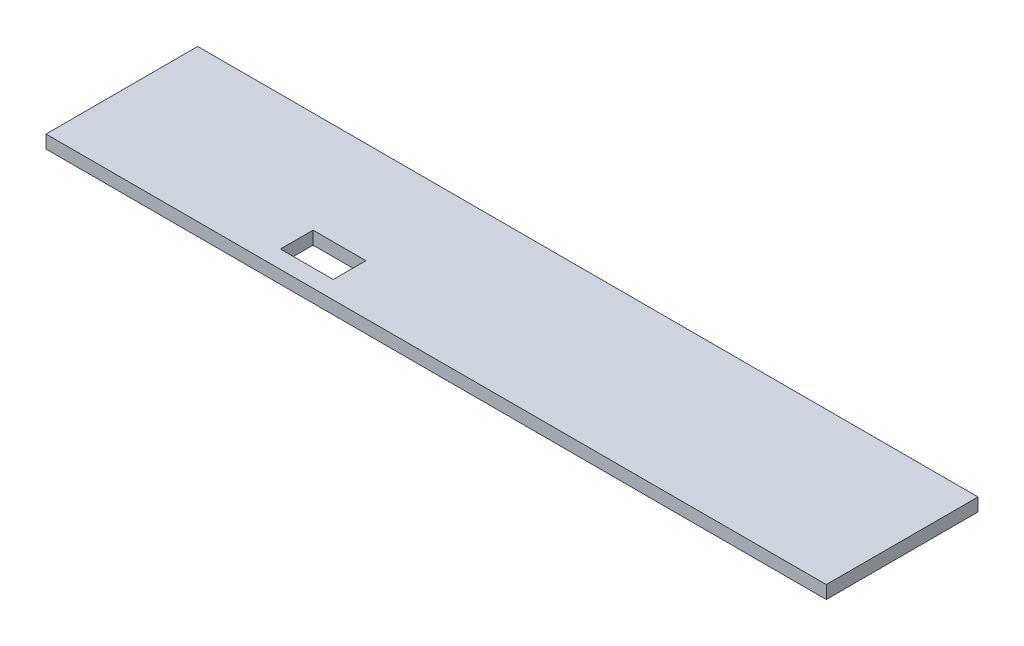
ISO-10303-21;
HEADER;
FILE_DESCRIPTION(('STEP AP214'),'2;1');
FILE_NAME('part.step','',(''),(''),'','','');
FILE_SCHEMA(('AUTOMOTIVE_DESIGN { 1 0 10303 214 1 1 1 1 }'));
ENDSEC;
DATA;
#1=APPLICATION_CONTEXT('core data for automotive mechanical design processes');
#2=APPLICATION_PROTOCOL_DEFINITION('international standard','automotive_design',2000,#1);
#3=PRODUCT_CONTEXT('',#1,'mechanical');
#4=PRODUCT('Part','Part','',(#3));
#5=PRODUCT_RELATED_PRODUCT_CATEGORY('part','',(#4));
#6=PRODUCT_DEFINITION_FORMATION('','',#4);
#7=PRODUCT_DEFINITION_CONTEXT('part definition',#1,'design');
#8=PRODUCT_DEFINITION('design','',#6,#7);
#9=PRODUCT_DEFINITION_SHAPE('','',#8);
#10=(LENGTH_UNIT() NAMED_UNIT(*) SI_UNIT(.MILLI.,.METRE.));
#11=(NAMED_UNIT(*) PLANE_ANGLE_UNIT() SI_UNIT($,.RADIAN.));
#12=(NAMED_UNIT(*) SI_UNIT($,.STERADIAN.) SOLID_ANGLE_UNIT());
#13=UNCERTAINTY_MEASURE_WITH_UNIT(LENGTH_MEASURE(1.E-05),#10,'distance_accuracy_value','');
#14=(GEOMETRIC_REPRESENTATION_CONTEXT(3) GLOBAL_UNCERTAINTY_ASSIGNED_CONTEXT((#13)) GLOBAL_UNIT_ASSIGNED_CONTEXT((#10,
#11,#12)) REPRESENTATION_CONTEXT('',''));
#15=CARTESIAN_POINT('',(0.,0.,0.));
#16=DIRECTION('',(0.,0.,1.));
#17=DIRECTION('',(1.,0.,0.));
#18=AXIS2_PLACEMENT_3D('',#15,#16,#17);
#19=CARTESIAN_POINT('',(-104.686936777344,3.,-23.6057346795657));
#20=DIRECTION('',(1.,0.,0.));
#21=DIRECTION('',(0.,0.,-1.));
#22=AXIS2_PLACEMENT_3D('',#19,#20,#21);
#23=PLANE('',#22);
#24=DIRECTION('',(0.,0.,1.));
#25=VECTOR('',#24,1.);
#26=CARTESIAN_POINT('',(-104.686936777344,0.,-23.6057346795657));
#27=LINE('',#26,#25);
#28=CARTESIAN_POINT('',(-104.686936777344,0.,-58.6057346795657));
#29=VERTEX_POINT('',#28);
#30=CARTESIAN_POINT('',(-104.686936777344,0.,-23.6057346795657));
#31=VERTEX_POINT('',#30);
#32=EDGE_CURVE('E130',#29,#31,#27,.T.);
#33=ORIENTED_EDGE('',*,*,#32,.T.);
#34=DIRECTION('',(0.,-1.,0.));
#35=VECTOR('',#34,1.);
#36=CARTESIAN_POINT('',(-104.686936777344,3.,-23.6057346795657));
#37=LINE('',#36,#35);
#38=CARTESIAN_POINT('',(-104.686936777344,3.,-23.6057346795657));
#39=VERTEX_POINT('',#38);
#40=EDGE_CURVE('E11',#39,#31,#37,.T.);
#41=ORIENTED_EDGE('',*,*,#40,.F.);
#42=DIRECTION('',(0.,0.,1.));
#43=VECTOR('',#42,1.);
#44=CARTESIAN_POINT('',(-104.686936777344,3.,-23.6057346795657));
#45=LINE('',#44,#43);
#46=CARTESIAN_POINT('',(-104.686936777344,3.,-58.6057346795657));
#47=VERTEX_POINT('',#46);
#48=EDGE_CURVE('E134',#47,#39,#45,.T.);
#49=ORIENTED_EDGE('',*,*,#48,.F.);
#50=DIRECTION('',(0.,-1.,0.));
#51=VECTOR('',#50,1.);
#52=CARTESIAN_POINT('',(-104.686936777344,3.,-58.6057346795657));
#53=LINE('',#52,#51);
#54=EDGE_CURVE('E144',#47,#29,#53,.T.);
#55=ORIENTED_EDGE('',*,*,#54,.T.);
#56=EDGE_LOOP('',(#33,#41,#49,#55));
#57=FACE_BOUND('',#56,.T.);
#58=ADVANCED_FACE('F33',(#57),#23,.F.);
#59=CARTESIAN_POINT('',(-104.686936777344,3.,-23.6057346795657));
#60=DIRECTION('',(0.,0.,-1.));
#61=DIRECTION('',(-1.,0.,0.));
#62=AXIS2_PLACEMENT_3D('',#59,#60,#61);
#63=PLANE('',#62);
#64=DIRECTION('',(1.,0.,0.));
#65=VECTOR('',#64,1.);
#66=CARTESIAN_POINT('',(-104.686936777344,0.,-23.6057346795657));
#67=LINE('',#66,#65);
#68=CARTESIAN_POINT('',(75.3130632226565,0.,-23.6057346795657));
#69=VERTEX_POINT('',#68);
#70=EDGE_CURVE('E147',#31,#69,#67,.T.);
#71=ORIENTED_EDGE('',*,*,#70,.T.);
#72=DIRECTION('',(0.,-1.,0.));
#73=VECTOR('',#72,1.);
#74=CARTESIAN_POINT('',(75.3130632226565,3.,-23.6057346795657));
#75=LINE('',#74,#73);
#76=CARTESIAN_POINT('',(75.3130632226565,3.,-23.6057346795657));
#77=VERTEX_POINT('',#76);
#78=EDGE_CURVE('E40',#77,#69,#75,.T.);
#79=ORIENTED_EDGE('',*,*,#78,.F.);
#80=DIRECTION('',(1.,0.,0.));
#81=VECTOR('',#80,1.);
#82=CARTESIAN_POINT('',(-104.686936777344,3.,-23.6057346795657));
#83=LINE('',#82,#81);
#84=EDGE_CURVE('E137',#39,#77,#83,.T.);
#85=ORIENTED_EDGE('',*,*,#84,.F.);
#86=ORIENTED_EDGE('',*,*,#40,.T.);
#87=EDGE_LOOP('',(#71,#79,#85,#86));
#88=FACE_BOUND('',#87,.T.);
#89=ADVANCED_FACE('F175',(#88),#63,.F.);
#90=CARTESIAN_POINT('',(75.3130632226565,3.,-23.6057346795657));
#91=DIRECTION('',(-1.,0.,0.));
#92=DIRECTION('',(0.,0.,1.));
#93=AXIS2_PLACEMENT_3D('',#90,#91,#92);
#94=PLANE('',#93);
#95=DIRECTION('',(0.,0.,-1.));
#96=VECTOR('',#95,1.);
#97=CARTESIAN_POINT('',(75.3130632226565,0.,-23.6057346795657));
#98=LINE('',#97,#96);
#99=CARTESIAN_POINT('',(75.3130632226565,0.,-58.6057346795657));
#100=VERTEX_POINT('',#99);
#101=EDGE_CURVE('E149',#69,#100,#98,.T.);
#102=ORIENTED_EDGE('',*,*,#101,.T.);
#103=DIRECTION('',(0.,-1.,0.));
#104=VECTOR('',#103,1.);
#105=CARTESIAN_POINT('',(75.3130632226565,3.,-58.6057346795657));
#106=LINE('',#105,#104);
#107=CARTESIAN_POINT('',(75.3130632226565,3.,-58.6057346795657));
#108=VERTEX_POINT('',#107);
#109=EDGE_CURVE('E154',#108,#100,#106,.T.);
#110=ORIENTED_EDGE('',*,*,#109,.F.);
#111=DIRECTION('',(0.,0.,-1.));
#112=VECTOR('',#111,1.);
#113=CARTESIAN_POINT('',(75.3130632226565,3.,-23.6057346795657));
#114=LINE('',#113,#112);
#115=EDGE_CURVE('E140',#77,#108,#114,.T.);
#116=ORIENTED_EDGE('',*,*,#115,.F.);
#117=ORIENTED_EDGE('',*,*,#78,.T.);
#118=EDGE_LOOP('',(#102,#110,#116,#117));
#119=FACE_BOUND('',#118,.T.);
#120=ADVANCED_FACE('F161',(#119),#94,.F.);
#121=CARTESIAN_POINT('',(-104.686936777344,3.,-58.6057346795657));
#122=DIRECTION('',(0.,0.,1.));
#123=DIRECTION('',(1.,0.,0.));
#124=AXIS2_PLACEMENT_3D('',#121,#122,#123);
#125=PLANE('',#124);
#126=DIRECTION('',(-1.,0.,0.));
#127=VECTOR('',#126,1.);
#128=CARTESIAN_POINT('',(-104.686936777344,0.,-58.6057346795657));
#129=LINE('',#128,#127);
#130=EDGE_CURVE('E138',#100,#29,#129,.T.);
#131=ORIENTED_EDGE('',*,*,#130,.T.);
#132=ORIENTED_EDGE('',*,*,#54,.F.);
#133=DIRECTION('',(-1.,0.,0.));
#134=VECTOR('',#133,1.);
#135=CARTESIAN_POINT('',(-104.686936777344,3.,-58.6057346795657));
#136=LINE('',#135,#134);
#137=EDGE_CURVE('E142',#108,#47,#136,.T.);
#138=ORIENTED_EDGE('',*,*,#137,.F.);
#139=ORIENTED_EDGE('',*,*,#109,.T.);
#140=EDGE_LOOP('',(#131,#132,#138,#139));
#141=FACE_BOUND('',#140,.T.);
#142=ADVANCED_FACE('F168',(#141),#125,.F.);
#143=CARTESIAN_POINT('',(0.,3.,0.));
#144=DIRECTION('',(0.,-1.,0.));
#145=DIRECTION('',(0.,0.,-1.));
#146=AXIS2_PLACEMENT_3D('',#143,#144,#145);
#147=PLANE('',#146);
#148=DIRECTION('',(1.,0.,0.));
#149=VECTOR('',#148,1.);
#150=CARTESIAN_POINT('',(-54.6869367773435,3.,-27.6757346795657));
#151=LINE('',#150,#149);
#152=CARTESIAN_POINT('',(-54.6869367773435,3.,-27.6757346795657));
#153=VERTEX_POINT('',#152);
#154=CARTESIAN_POINT('',(-42.4869367773435,3.,-27.6757346795657));
#155=VERTEX_POINT('',#154);
#156=EDGE_CURVE('E124',#153,#155,#151,.T.);
#157=ORIENTED_EDGE('',*,*,#156,.F.);
#158=DIRECTION('',(0.,0.,1.));
#159=VECTOR('',#158,1.);
#160=CARTESIAN_POINT('',(-54.6869367773435,3.,-35.2057346795657));
#161=LINE('',#160,#159);
#162=CARTESIAN_POINT('',(-54.6869367773435,3.,-35.2057346795657));
#163=VERTEX_POINT('',#162);
#164=EDGE_CURVE('E47',#163,#153,#161,.T.);
#165=ORIENTED_EDGE('',*,*,#164,.F.);
#166=DIRECTION('',(-1.,0.,0.));
#167=VECTOR('',#166,1.);
#168=CARTESIAN_POINT('',(-54.6869367773435,3.,-35.2057346795657));
#169=LINE('',#168,#167);
#170=CARTESIAN_POINT('',(-42.4869367773435,3.,-35.2057346795657));
#171=VERTEX_POINT('',#170);
#172=EDGE_CURVE('E115',#171,#163,#169,.T.);
#173=ORIENTED_EDGE('',*,*,#172,.F.);
#174=DIRECTION('',(0.,0.,-1.));
#175=VECTOR('',#174,1.);
#176=CARTESIAN_POINT('',(-42.4869367773435,3.,-35.2057346795657));
#177=LINE('',#176,#175);
#178=EDGE_CURVE('E118',#155,#171,#177,.T.);
#179=ORIENTED_EDGE('',*,*,#178,.F.);
#180=EDGE_LOOP('',(#157,#165,#173,#179));
#181=FACE_BOUND('',#180,.T.);
#182=ORIENTED_EDGE('',*,*,#48,.T.);
#183=ORIENTED_EDGE('',*,*,#84,.T.);
#184=ORIENTED_EDGE('',*,*,#115,.T.);
#185=ORIENTED_EDGE('',*,*,#137,.T.);
#186=EDGE_LOOP('',(#182,#183,#184,#185));
#187=FACE_BOUND('',#186,.T.);
#188=ADVANCED_FACE('F174',(#181,#187),#147,.F.);
#189=CARTESIAN_POINT('',(0.,0.,0.));
#190=DIRECTION('',(0.,-1.,0.));
#191=DIRECTION('',(0.,0.,-1.));
#192=AXIS2_PLACEMENT_3D('',#189,#190,#191);
#193=PLANE('',#192);
#194=DIRECTION('',(0.,0.,1.));
#195=VECTOR('',#194,1.);
#196=CARTESIAN_POINT('',(-54.6869367773435,0.,-35.2057346795657));
#197=LINE('',#196,#195);
#198=CARTESIAN_POINT('',(-54.6869367773435,0.,-35.2057346795657));
#199=VERTEX_POINT('',#198);
#200=CARTESIAN_POINT('',(-54.6869367773435,0.,-27.6757346795657));
#201=VERTEX_POINT('',#200);
#202=EDGE_CURVE('E99',#199,#201,#197,.T.);
#203=ORIENTED_EDGE('',*,*,#202,.T.);
#204=DIRECTION('',(1.,0.,0.));
#205=VECTOR('',#204,1.);
#206=CARTESIAN_POINT('',(-54.6869367773435,0.,-27.6757346795657));
#207=LINE('',#206,#205);
#208=CARTESIAN_POINT('',(-42.4869367773435,0.,-27.6757346795657));
#209=VERTEX_POINT('',#208);
#210=EDGE_CURVE('E108',#201,#209,#207,.T.);
#211=ORIENTED_EDGE('',*,*,#210,.T.);
#212=DIRECTION('',(0.,0.,-1.));
#213=VECTOR('',#212,1.);
#214=CARTESIAN_POINT('',(-42.4869367773435,0.,-35.2057346795657));
#215=LINE('',#214,#213);
#216=CARTESIAN_POINT('',(-42.4869367773435,0.,-35.2057346795657));
#217=VERTEX_POINT('',#216);
#218=EDGE_CURVE('E55',#209,#217,#215,.T.);
#219=ORIENTED_EDGE('',*,*,#218,.T.);
#220=DIRECTION('',(-1.,0.,0.));
#221=VECTOR('',#220,1.);
#222=CARTESIAN_POINT('',(-54.6869367773435,0.,-35.2057346795657));
#223=LINE('',#222,#221);
#224=EDGE_CURVE('E105',#217,#199,#223,.T.);
#225=ORIENTED_EDGE('',*,*,#224,.T.);
#226=EDGE_LOOP('',(#203,#211,#219,#225));
#227=FACE_BOUND('',#226,.T.);
#228=ORIENTED_EDGE('',*,*,#32,.F.);
#229=ORIENTED_EDGE('',*,*,#130,.F.);
#230=ORIENTED_EDGE('',*,*,#101,.F.);
#231=ORIENTED_EDGE('',*,*,#70,.F.);
#232=EDGE_LOOP('',(#228,#229,#230,#231));
#233=FACE_BOUND('',#232,.T.);
#234=ADVANCED_FACE('F112',(#227,#233),#193,.T.);
#235=CARTESIAN_POINT('',(-54.6869367773435,0.,-35.2057346795657));
#236=DIRECTION('',(-1.,0.,0.));
#237=DIRECTION('',(0.,0.,1.));
#238=AXIS2_PLACEMENT_3D('',#235,#236,#237);
#239=PLANE('',#238);
#240=ORIENTED_EDGE('',*,*,#164,.T.);
#241=DIRECTION('',(0.,1.,0.));
#242=VECTOR('',#241,1.);
#243=CARTESIAN_POINT('',(-54.6869367773435,0.,-27.6757346795657));
#244=LINE('',#243,#242);
#245=EDGE_CURVE('E95',#201,#153,#244,.T.);
#246=ORIENTED_EDGE('',*,*,#245,.F.);
#247=ORIENTED_EDGE('',*,*,#202,.F.);
#248=DIRECTION('',(0.,1.,0.));
#249=VECTOR('',#248,1.);
#250=CARTESIAN_POINT('',(-54.6869367773435,0.,-35.2057346795657));
#251=LINE('',#250,#249);
#252=EDGE_CURVE('E128',#199,#163,#251,.T.);
#253=ORIENTED_EDGE('',*,*,#252,.T.);
#254=EDGE_LOOP('',(#240,#246,#247,#253));
#255=FACE_BOUND('',#254,.T.);
#256=ADVANCED_FACE('F97',(#255),#239,.F.);
#257=CARTESIAN_POINT('',(-54.6869367773435,0.,-35.2057346795657));
#258=DIRECTION('',(0.,0.,-1.));
#259=DIRECTION('',(-1.,0.,0.));
#260=AXIS2_PLACEMENT_3D('',#257,#258,#259);
#261=PLANE('',#260);
#262=ORIENTED_EDGE('',*,*,#172,.T.);
#263=ORIENTED_EDGE('',*,*,#252,.F.);
#264=ORIENTED_EDGE('',*,*,#224,.F.);
#265=DIRECTION('',(0.,1.,0.));
#266=VECTOR('',#265,1.);
#267=CARTESIAN_POINT('',(-42.4869367773435,0.,-35.2057346795657));
#268=LINE('',#267,#266);
#269=EDGE_CURVE('E131',#217,#171,#268,.T.);
#270=ORIENTED_EDGE('',*,*,#269,.T.);
#271=EDGE_LOOP('',(#262,#263,#264,#270));
#272=FACE_BOUND('',#271,.T.);
#273=ADVANCED_FACE('F192',(#272),#261,.F.);
#274=CARTESIAN_POINT('',(-42.4869367773435,0.,-35.2057346795657));
#275=DIRECTION('',(1.,0.,0.));
#276=DIRECTION('',(0.,0.,-1.));
#277=AXIS2_PLACEMENT_3D('',#274,#275,#276);
#278=PLANE('',#277);
#279=ORIENTED_EDGE('',*,*,#178,.T.);
#280=ORIENTED_EDGE('',*,*,#269,.F.);
#281=ORIENTED_EDGE('',*,*,#218,.F.);
#282=DIRECTION('',(0.,1.,0.));
#283=VECTOR('',#282,1.);
#284=CARTESIAN_POINT('',(-42.4869367773435,0.,-27.6757346795657));
#285=LINE('',#284,#283);
#286=EDGE_CURVE('E104',#209,#155,#285,.T.);
#287=ORIENTED_EDGE('',*,*,#286,.T.);
#288=EDGE_LOOP('',(#279,#280,#281,#287));
#289=FACE_BOUND('',#288,.T.);
#290=ADVANCED_FACE('F195',(#289),#278,.F.);
#291=CARTESIAN_POINT('',(-54.6869367773435,0.,-27.6757346795657));
#292=DIRECTION('',(0.,0.,1.));
#293=DIRECTION('',(1.,0.,0.));
#294=AXIS2_PLACEMENT_3D('',#291,#292,#293);
#295=PLANE('',#294);
#296=ORIENTED_EDGE('',*,*,#156,.T.);
#297=ORIENTED_EDGE('',*,*,#286,.F.);
#298=ORIENTED_EDGE('',*,*,#210,.F.);
#299=ORIENTED_EDGE('',*,*,#245,.T.);
#300=EDGE_LOOP('',(#296,#297,#298,#299));
#301=FACE_BOUND('',#300,.T.);
#302=ADVANCED_FACE('F109',(#301),#295,.F.);
#303=CLOSED_SHELL('',(#58,#89,#120,#142,#188,#234,#256,#273,#290,#302));
#304=MANIFOLD_SOLID_BREP('B2',#303);
#305=ADVANCED_BREP_SHAPE_REPRESENTATION('',(#18,#304),#14);
#306=SHAPE_DEFINITION_REPRESENTATION(#9,#305);
ENDSEC;
END-ISO-10303-21;
